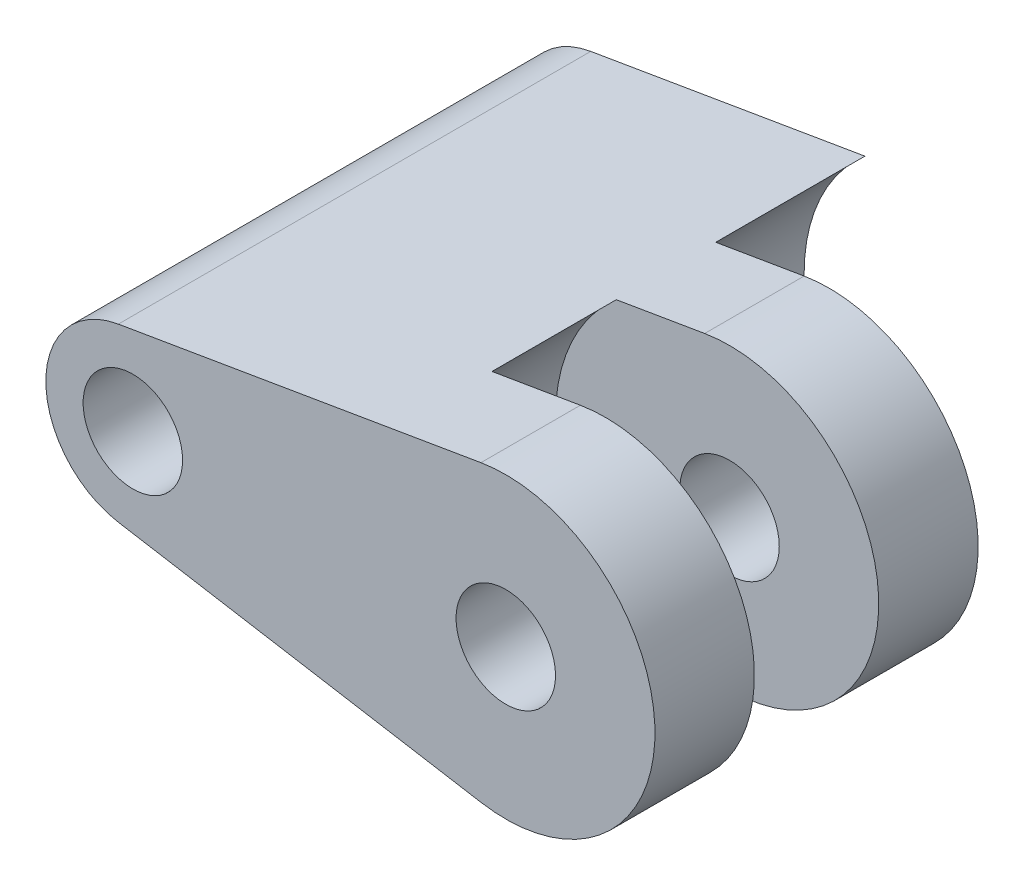
ISO-10303-21;
HEADER;
FILE_DESCRIPTION(('STEP AP214'),'2;1');
FILE_NAME('part.step','',(''),(''),'','','');
FILE_SCHEMA(('AUTOMOTIVE_DESIGN { 1 0 10303 214 1 1 1 1 }'));
ENDSEC;
DATA;
#1=APPLICATION_CONTEXT('core data for automotive mechanical design processes');
#2=APPLICATION_PROTOCOL_DEFINITION('international standard','automotive_design',2000,#1);
#3=PRODUCT_CONTEXT('',#1,'mechanical');
#4=PRODUCT('Part','Part','',(#3));
#5=PRODUCT_RELATED_PRODUCT_CATEGORY('part','',(#4));
#6=PRODUCT_DEFINITION_FORMATION('','',#4);
#7=PRODUCT_DEFINITION_CONTEXT('part definition',#1,'design');
#8=PRODUCT_DEFINITION('design','',#6,#7);
#9=PRODUCT_DEFINITION_SHAPE('','',#8);
#10=(LENGTH_UNIT() NAMED_UNIT(*) SI_UNIT(.MILLI.,.METRE.));
#11=(NAMED_UNIT(*) PLANE_ANGLE_UNIT() SI_UNIT($,.RADIAN.));
#12=(NAMED_UNIT(*) SI_UNIT($,.STERADIAN.) SOLID_ANGLE_UNIT());
#13=UNCERTAINTY_MEASURE_WITH_UNIT(LENGTH_MEASURE(1.E-05),#10,'distance_accuracy_value','');
#14=(GEOMETRIC_REPRESENTATION_CONTEXT(3) GLOBAL_UNCERTAINTY_ASSIGNED_CONTEXT((#13)) GLOBAL_UNIT_ASSIGNED_CONTEXT((#10,
#11,#12)) REPRESENTATION_CONTEXT('',''));
#15=CARTESIAN_POINT('',(0.,0.,0.));
#16=DIRECTION('',(0.,0.,1.));
#17=DIRECTION('',(1.,0.,0.));
#18=AXIS2_PLACEMENT_3D('',#15,#16,#17);
#19=CARTESIAN_POINT('',(15.,0.,19.));
#20=DIRECTION('',(0.,0.,-1.));
#21=DIRECTION('',(-1.,0.,0.));
#22=AXIS2_PLACEMENT_3D('',#19,#20,#21);
#23=CYLINDRICAL_SURFACE('',#22,7.);
#24=DIRECTION('',(0.,0.,-1.));
#25=VECTOR('',#24,1.);
#26=CARTESIAN_POINT('',(10.4448784987164,5.31515457052229,19.));
#27=LINE('',#26,#25);
#28=CARTESIAN_POINT('',(10.4448784987164,5.31515457052229,15.));
#29=VERTEX_POINT('',#28);
#30=CARTESIAN_POINT('',(10.4448784987164,5.31515457052229,10.));
#31=VERTEX_POINT('',#30);
#32=EDGE_CURVE('E62',#29,#31,#27,.T.);
#33=ORIENTED_EDGE('',*,*,#32,.F.);
#34=CARTESIAN_POINT('',(15.,0.,15.));
#35=DIRECTION('',(0.,0.,1.));
#36=DIRECTION('',(1.,0.,0.));
#37=AXIS2_PLACEMENT_3D('',#34,#35,#36);
#38=CIRCLE('',#37,7.);
#39=CARTESIAN_POINT('',(10.4448784987164,-5.31515457052229,15.));
#40=VERTEX_POINT('',#39);
#41=EDGE_CURVE('E57',#29,#40,#38,.T.);
#42=ORIENTED_EDGE('',*,*,#41,.T.);
#43=DIRECTION('',(0.,0.,-1.));
#44=VECTOR('',#43,1.);
#45=CARTESIAN_POINT('',(10.4448784987164,-5.31515457052229,19.));
#46=LINE('',#45,#44);
#47=CARTESIAN_POINT('',(10.4448784987164,-5.31515457052229,10.));
#48=VERTEX_POINT('',#47);
#49=EDGE_CURVE('E50',#40,#48,#46,.T.);
#50=ORIENTED_EDGE('',*,*,#49,.T.);
#51=CARTESIAN_POINT('',(15.,0.,10.));
#52=DIRECTION('',(0.,0.,1.));
#53=DIRECTION('',(1.,0.,0.));
#54=AXIS2_PLACEMENT_3D('',#51,#52,#53);
#55=CIRCLE('',#54,7.);
#56=EDGE_CURVE('E174',#31,#48,#55,.T.);
#57=ORIENTED_EDGE('',*,*,#56,.F.);
#58=EDGE_LOOP('',(#33,#42,#50,#57));
#59=FACE_BOUND('',#58,.T.);
#60=ADVANCED_FACE('F41',(#59),#23,.F.);
#61=CARTESIAN_POINT('',(10.4448784987164,5.31515457052229,6.));
#62=VERTEX_POINT('',#61);
#63=CARTESIAN_POINT('',(10.4448784987164,5.31515457052229,0.));
#64=VERTEX_POINT('',#63);
#65=EDGE_CURVE('E243',#62,#64,#27,.T.);
#66=ORIENTED_EDGE('',*,*,#65,.F.);
#67=CARTESIAN_POINT('',(15.,0.,6.));
#68=DIRECTION('',(0.,0.,1.));
#69=DIRECTION('',(1.,0.,0.));
#70=AXIS2_PLACEMENT_3D('',#67,#68,#69);
#71=CIRCLE('',#70,7.);
#72=CARTESIAN_POINT('',(10.4448784987164,-5.31515457052229,6.));
#73=VERTEX_POINT('',#72);
#74=EDGE_CURVE('E193',#62,#73,#71,.T.);
#75=ORIENTED_EDGE('',*,*,#74,.T.);
#76=CARTESIAN_POINT('',(10.4448784987164,-5.31515457052229,0.));
#77=VERTEX_POINT('',#76);
#78=EDGE_CURVE('E245',#73,#77,#46,.T.);
#79=ORIENTED_EDGE('',*,*,#78,.T.);
#80=CARTESIAN_POINT('',(15.,0.,0.));
#81=DIRECTION('',(0.,0.,1.));
#82=DIRECTION('',(1.,0.,0.));
#83=AXIS2_PLACEMENT_3D('',#80,#81,#82);
#84=CIRCLE('',#83,7.);
#85=EDGE_CURVE('E234',#64,#77,#84,.T.);
#86=ORIENTED_EDGE('',*,*,#85,.F.);
#87=EDGE_LOOP('',(#66,#75,#79,#86));
#88=FACE_BOUND('',#87,.T.);
#89=ADVANCED_FACE('F252',(#88),#23,.F.);
#90=CARTESIAN_POINT('',(0.,0.,19.));
#91=DIRECTION('',(0.,0.,-1.));
#92=DIRECTION('',(-1.,0.,0.));
#93=AXIS2_PLACEMENT_3D('',#90,#91,#92);
#94=CYLINDRICAL_SURFACE('',#93,3.5);
#95=CARTESIAN_POINT('',(0.,0.,0.));
#96=DIRECTION('',(0.,0.,1.));
#97=DIRECTION('',(1.,0.,0.));
#98=AXIS2_PLACEMENT_3D('',#95,#96,#97);
#99=CIRCLE('',#98,3.5);
#100=CARTESIAN_POINT('',(-0.583333333333333,3.45104654014144,0.));
#101=VERTEX_POINT('',#100);
#102=CARTESIAN_POINT('',(-0.583333333333333,-3.45104654014144,0.));
#103=VERTEX_POINT('',#102);
#104=EDGE_CURVE('E227',#101,#103,#99,.T.);
#105=ORIENTED_EDGE('',*,*,#104,.T.);
#106=DIRECTION('',(0.,0.,-1.));
#107=VECTOR('',#106,1.);
#108=CARTESIAN_POINT('',(-0.583333333333333,-3.45104654014144,19.));
#109=LINE('',#108,#107);
#110=CARTESIAN_POINT('',(-0.583333333333333,-3.45104654014144,19.));
#111=VERTEX_POINT('',#110);
#112=EDGE_CURVE('E11',#111,#103,#109,.T.);
#113=ORIENTED_EDGE('',*,*,#112,.F.);
#114=CARTESIAN_POINT('',(0.,0.,19.));
#115=DIRECTION('',(0.,0.,1.));
#116=DIRECTION('',(1.,0.,0.));
#117=AXIS2_PLACEMENT_3D('',#114,#115,#116);
#118=CIRCLE('',#117,3.5);
#119=CARTESIAN_POINT('',(-0.583333333333333,3.45104654014144,19.));
#120=VERTEX_POINT('',#119);
#121=EDGE_CURVE('E126',#120,#111,#118,.T.);
#122=ORIENTED_EDGE('',*,*,#121,.F.);
#123=DIRECTION('',(0.,0.,-1.));
#124=VECTOR('',#123,1.);
#125=CARTESIAN_POINT('',(-0.583333333333333,3.45104654014144,19.));
#126=LINE('',#125,#124);
#127=EDGE_CURVE('E223',#120,#101,#126,.T.);
#128=ORIENTED_EDGE('',*,*,#127,.T.);
#129=EDGE_LOOP('',(#105,#113,#122,#128));
#130=FACE_BOUND('',#129,.T.);
#131=ADVANCED_FACE('F296',(#130),#94,.T.);
#132=CARTESIAN_POINT('',(-0.583333333333333,-3.45104654014144,19.));
#133=DIRECTION('',(0.166666666666667,0.986013297183269,0.));
#134=DIRECTION('',(-0.986013297183269,0.166666666666667,0.));
#135=AXIS2_PLACEMENT_3D('',#132,#133,#134);
#136=PLANE('',#135);
#137=DIRECTION('',(0.986013297183269,-0.166666666666667,0.));
#138=VECTOR('',#137,1.);
#139=CARTESIAN_POINT('',(-0.583333333333333,-3.45104654014144,0.));
#140=LINE('',#139,#138);
#141=EDGE_CURVE('E231',#103,#77,#140,.T.);
#142=ORIENTED_EDGE('',*,*,#141,.T.);
#143=ORIENTED_EDGE('',*,*,#78,.F.);
#144=DIRECTION('',(0.986013297183269,-0.166666666666667,0.));
#145=VECTOR('',#144,1.);
#146=CARTESIAN_POINT('',(-0.583333333333333,-3.45104654014144,6.));
#147=LINE('',#146,#145);
#148=CARTESIAN_POINT('',(14.,-5.91607978309961,6.));
#149=VERTEX_POINT('',#148);
#150=EDGE_CURVE('E197',#73,#149,#147,.T.);
#151=ORIENTED_EDGE('',*,*,#150,.T.);
#152=DIRECTION('',(0.,0.,-1.));
#153=VECTOR('',#152,1.);
#154=CARTESIAN_POINT('',(14.,-5.91607978309961,10.));
#155=LINE('',#154,#153);
#156=CARTESIAN_POINT('',(14.,-5.91607978309961,10.));
#157=VERTEX_POINT('',#156);
#158=EDGE_CURVE('E209',#157,#149,#155,.T.);
#159=ORIENTED_EDGE('',*,*,#158,.F.);
#160=DIRECTION('',(0.986013297183269,-0.166666666666667,0.));
#161=VECTOR('',#160,1.);
#162=CARTESIAN_POINT('',(-0.583333333333333,-3.45104654014144,10.));
#163=LINE('',#162,#161);
#164=EDGE_CURVE('E179',#48,#157,#163,.T.);
#165=ORIENTED_EDGE('',*,*,#164,.F.);
#166=ORIENTED_EDGE('',*,*,#49,.F.);
#167=DIRECTION('',(0.986013297183269,-0.166666666666667,0.));
#168=VECTOR('',#167,1.);
#169=CARTESIAN_POINT('',(-0.583333333333333,-3.45104654014144,15.));
#170=LINE('',#169,#168);
#171=CARTESIAN_POINT('',(14.,-5.91607978309961,15.));
#172=VERTEX_POINT('',#171);
#173=EDGE_CURVE('E137',#40,#172,#170,.T.);
#174=ORIENTED_EDGE('',*,*,#173,.T.);
#175=DIRECTION('',(0.,0.,-1.));
#176=VECTOR('',#175,1.);
#177=CARTESIAN_POINT('',(14.,-5.91607978309961,19.));
#178=LINE('',#177,#176);
#179=CARTESIAN_POINT('',(14.,-5.91607978309961,19.));
#180=VERTEX_POINT('',#179);
#181=EDGE_CURVE('E133',#180,#172,#178,.T.);
#182=ORIENTED_EDGE('',*,*,#181,.F.);
#183=DIRECTION('',(0.986013297183269,-0.166666666666667,0.));
#184=VECTOR('',#183,1.);
#185=CARTESIAN_POINT('',(-0.583333333333333,-3.45104654014144,19.));
#186=LINE('',#185,#184);
#187=EDGE_CURVE('E117',#111,#180,#186,.T.);
#188=ORIENTED_EDGE('',*,*,#187,.F.);
#189=ORIENTED_EDGE('',*,*,#112,.T.);
#190=EDGE_LOOP('',(#142,#143,#151,#159,#165,#166,#174,#182,#188,#189));
#191=FACE_BOUND('',#190,.T.);
#192=ADVANCED_FACE('F135',(#191),#136,.F.);
#193=CARTESIAN_POINT('',(0.,0.,19.));
#194=DIRECTION('',(0.,0.,-1.));
#195=DIRECTION('',(-1.,0.,0.));
#196=AXIS2_PLACEMENT_3D('',#193,#194,#195);
#197=CYLINDRICAL_SURFACE('',#196,2.);
#198=CARTESIAN_POINT('',(0.,0.,19.));
#199=DIRECTION('',(0.,0.,1.));
#200=DIRECTION('',(1.,0.,0.));
#201=AXIS2_PLACEMENT_3D('',#198,#199,#200);
#202=CIRCLE('',#201,2.);
#203=CARTESIAN_POINT('',(2.,0.,19.));
#204=VERTEX_POINT('',#203);
#205=EDGE_CURVE('E214',#204,#204,#202,.T.);
#206=ORIENTED_EDGE('',*,*,#205,.T.);
#207=EDGE_LOOP('',(#206));
#208=FACE_BOUND('',#207,.T.);
#209=CARTESIAN_POINT('',(0.,0.,0.));
#210=DIRECTION('',(0.,0.,1.));
#211=DIRECTION('',(1.,0.,0.));
#212=AXIS2_PLACEMENT_3D('',#209,#210,#211);
#213=CIRCLE('',#212,2.);
#214=CARTESIAN_POINT('',(2.,0.,0.));
#215=VERTEX_POINT('',#214);
#216=EDGE_CURVE('E213',#215,#215,#213,.T.);
#217=ORIENTED_EDGE('',*,*,#216,.F.);
#218=EDGE_LOOP('',(#217));
#219=FACE_BOUND('',#218,.T.);
#220=ADVANCED_FACE('F43',(#208,#219),#197,.F.);
#221=CARTESIAN_POINT('',(-0.583333333333333,3.45104654014144,19.));
#222=DIRECTION('',(-0.166666666666667,0.986013297183269,0.));
#223=DIRECTION('',(-0.986013297183269,-0.166666666666667,0.));
#224=AXIS2_PLACEMENT_3D('',#221,#222,#223);
#225=PLANE('',#224);
#226=DIRECTION('',(0.986013297183269,0.166666666666667,0.));
#227=VECTOR('',#226,1.);
#228=CARTESIAN_POINT('',(-0.583333333333333,3.45104654014144,0.));
#229=LINE('',#228,#227);
#230=EDGE_CURVE('E218',#101,#64,#229,.T.);
#231=ORIENTED_EDGE('',*,*,#230,.F.);
#232=ORIENTED_EDGE('',*,*,#127,.F.);
#233=DIRECTION('',(0.986013297183269,0.166666666666667,0.));
#234=VECTOR('',#233,1.);
#235=CARTESIAN_POINT('',(-0.583333333333333,3.45104654014144,19.));
#236=LINE('',#235,#234);
#237=CARTESIAN_POINT('',(14.,5.91607978309962,19.));
#238=VERTEX_POINT('',#237);
#239=EDGE_CURVE('E130',#120,#238,#236,.T.);
#240=ORIENTED_EDGE('',*,*,#239,.T.);
#241=DIRECTION('',(0.,0.,-1.));
#242=VECTOR('',#241,1.);
#243=CARTESIAN_POINT('',(14.,5.91607978309962,19.));
#244=LINE('',#243,#242);
#245=CARTESIAN_POINT('',(14.,5.91607978309962,15.));
#246=VERTEX_POINT('',#245);
#247=EDGE_CURVE('E143',#238,#246,#244,.T.);
#248=ORIENTED_EDGE('',*,*,#247,.T.);
#249=DIRECTION('',(0.986013297183269,0.166666666666667,0.));
#250=VECTOR('',#249,1.);
#251=CARTESIAN_POINT('',(-0.583333333333333,3.45104654014144,15.));
#252=LINE('',#251,#250);
#253=EDGE_CURVE('E158',#29,#246,#252,.T.);
#254=ORIENTED_EDGE('',*,*,#253,.F.);
#255=ORIENTED_EDGE('',*,*,#32,.T.);
#256=DIRECTION('',(0.986013297183269,0.166666666666667,0.));
#257=VECTOR('',#256,1.);
#258=CARTESIAN_POINT('',(-0.583333333333333,3.45104654014144,10.));
#259=LINE('',#258,#257);
#260=CARTESIAN_POINT('',(14.,5.91607978309962,10.));
#261=VERTEX_POINT('',#260);
#262=EDGE_CURVE('E170',#31,#261,#259,.T.);
#263=ORIENTED_EDGE('',*,*,#262,.T.);
#264=DIRECTION('',(0.,0.,-1.));
#265=VECTOR('',#264,1.);
#266=CARTESIAN_POINT('',(14.,5.91607978309962,10.));
#267=LINE('',#266,#265);
#268=CARTESIAN_POINT('',(14.,5.91607978309962,6.));
#269=VERTEX_POINT('',#268);
#270=EDGE_CURVE('E189',#261,#269,#267,.T.);
#271=ORIENTED_EDGE('',*,*,#270,.T.);
#272=DIRECTION('',(0.986013297183269,0.166666666666667,0.));
#273=VECTOR('',#272,1.);
#274=CARTESIAN_POINT('',(-0.583333333333333,3.45104654014144,6.));
#275=LINE('',#274,#273);
#276=EDGE_CURVE('E142',#62,#269,#275,.T.);
#277=ORIENTED_EDGE('',*,*,#276,.F.);
#278=ORIENTED_EDGE('',*,*,#65,.T.);
#279=EDGE_LOOP('',(#231,#232,#240,#248,#254,#255,#263,#271,#277,#278));
#280=FACE_BOUND('',#279,.T.);
#281=ADVANCED_FACE('F259',(#280),#225,.T.);
#282=CARTESIAN_POINT('',(0.,0.,19.));
#283=DIRECTION('',(0.,0.,1.));
#284=DIRECTION('',(1.,0.,0.));
#285=AXIS2_PLACEMENT_3D('',#282,#283,#284);
#286=PLANE('',#285);
#287=ORIENTED_EDGE('',*,*,#205,.F.);
#288=EDGE_LOOP('',(#287));
#289=FACE_BOUND('',#288,.T.);
#290=ORIENTED_EDGE('',*,*,#121,.T.);
#291=ORIENTED_EDGE('',*,*,#187,.T.);
#292=CARTESIAN_POINT('',(15.,0.,19.));
#293=DIRECTION('',(0.,0.,1.));
#294=DIRECTION('',(1.,0.,0.));
#295=AXIS2_PLACEMENT_3D('',#292,#293,#294);
#296=CIRCLE('',#295,6.);
#297=EDGE_CURVE('E123',#180,#238,#296,.T.);
#298=ORIENTED_EDGE('',*,*,#297,.T.);
#299=ORIENTED_EDGE('',*,*,#239,.F.);
#300=EDGE_LOOP('',(#290,#291,#298,#299));
#301=FACE_BOUND('',#300,.T.);
#302=CARTESIAN_POINT('',(15.,0.,19.));
#303=DIRECTION('',(0.,0.,1.));
#304=DIRECTION('',(1.,0.,0.));
#305=AXIS2_PLACEMENT_3D('',#302,#303,#304);
#306=CIRCLE('',#305,2.);
#307=CARTESIAN_POINT('',(17.,0.,19.));
#308=VERTEX_POINT('',#307);
#309=EDGE_CURVE('E147',#308,#308,#306,.T.);
#310=ORIENTED_EDGE('',*,*,#309,.F.);
#311=EDGE_LOOP('',(#310));
#312=FACE_BOUND('',#311,.T.);
#313=ADVANCED_FACE('F119',(#289,#301,#312),#286,.T.);
#314=CARTESIAN_POINT('',(0.,0.,0.));
#315=DIRECTION('',(0.,0.,1.));
#316=DIRECTION('',(1.,0.,0.));
#317=AXIS2_PLACEMENT_3D('',#314,#315,#316);
#318=PLANE('',#317);
#319=ORIENTED_EDGE('',*,*,#216,.T.);
#320=EDGE_LOOP('',(#319));
#321=FACE_BOUND('',#320,.T.);
#322=ORIENTED_EDGE('',*,*,#104,.F.);
#323=ORIENTED_EDGE('',*,*,#230,.T.);
#324=ORIENTED_EDGE('',*,*,#85,.T.);
#325=ORIENTED_EDGE('',*,*,#141,.F.);
#326=EDGE_LOOP('',(#322,#323,#324,#325));
#327=FACE_BOUND('',#326,.T.);
#328=ADVANCED_FACE('F256',(#321,#327),#318,.F.);
#329=CARTESIAN_POINT('',(15.,0.,10.));
#330=DIRECTION('',(0.,0.,-1.));
#331=DIRECTION('',(-1.,0.,0.));
#332=AXIS2_PLACEMENT_3D('',#329,#330,#331);
#333=CYLINDRICAL_SURFACE('',#332,6.);
#334=CARTESIAN_POINT('',(15.,0.,6.));
#335=DIRECTION('',(0.,0.,1.));
#336=DIRECTION('',(1.,0.,0.));
#337=AXIS2_PLACEMENT_3D('',#334,#335,#336);
#338=CIRCLE('',#337,6.);
#339=EDGE_CURVE('E200',#149,#269,#338,.T.);
#340=ORIENTED_EDGE('',*,*,#339,.T.);
#341=ORIENTED_EDGE('',*,*,#270,.F.);
#342=CARTESIAN_POINT('',(15.,0.,10.));
#343=DIRECTION('',(0.,0.,1.));
#344=DIRECTION('',(1.,0.,0.));
#345=AXIS2_PLACEMENT_3D('',#342,#343,#344);
#346=CIRCLE('',#345,6.);
#347=EDGE_CURVE('E182',#157,#261,#346,.T.);
#348=ORIENTED_EDGE('',*,*,#347,.F.);
#349=ORIENTED_EDGE('',*,*,#158,.T.);
#350=EDGE_LOOP('',(#340,#341,#348,#349));
#351=FACE_BOUND('',#350,.T.);
#352=ADVANCED_FACE('F270',(#351),#333,.T.);
#353=CARTESIAN_POINT('',(15.,0.,10.));
#354=DIRECTION('',(0.,0.,-1.));
#355=DIRECTION('',(-1.,0.,0.));
#356=AXIS2_PLACEMENT_3D('',#353,#354,#355);
#357=CYLINDRICAL_SURFACE('',#356,2.);
#358=CARTESIAN_POINT('',(15.,0.,10.));
#359=DIRECTION('',(0.,0.,1.));
#360=DIRECTION('',(1.,0.,0.));
#361=AXIS2_PLACEMENT_3D('',#358,#359,#360);
#362=CIRCLE('',#361,2.);
#363=CARTESIAN_POINT('',(17.,0.,10.));
#364=VERTEX_POINT('',#363);
#365=EDGE_CURVE('E185',#364,#364,#362,.T.);
#366=ORIENTED_EDGE('',*,*,#365,.T.);
#367=EDGE_LOOP('',(#366));
#368=FACE_BOUND('',#367,.T.);
#369=CARTESIAN_POINT('',(15.,0.,6.));
#370=DIRECTION('',(0.,0.,1.));
#371=DIRECTION('',(1.,0.,0.));
#372=AXIS2_PLACEMENT_3D('',#369,#370,#371);
#373=CIRCLE('',#372,2.);
#374=CARTESIAN_POINT('',(17.,0.,6.));
#375=VERTEX_POINT('',#374);
#376=EDGE_CURVE('E175',#375,#375,#373,.T.);
#377=ORIENTED_EDGE('',*,*,#376,.F.);
#378=EDGE_LOOP('',(#377));
#379=FACE_BOUND('',#378,.T.);
#380=ADVANCED_FACE('F342',(#368,#379),#357,.F.);
#381=CARTESIAN_POINT('',(0.,0.,10.));
#382=DIRECTION('',(0.,0.,1.));
#383=DIRECTION('',(1.,0.,0.));
#384=AXIS2_PLACEMENT_3D('',#381,#382,#383);
#385=PLANE('',#384);
#386=ORIENTED_EDGE('',*,*,#262,.F.);
#387=ORIENTED_EDGE('',*,*,#56,.T.);
#388=ORIENTED_EDGE('',*,*,#164,.T.);
#389=ORIENTED_EDGE('',*,*,#347,.T.);
#390=EDGE_LOOP('',(#386,#387,#388,#389));
#391=FACE_BOUND('',#390,.T.);
#392=ORIENTED_EDGE('',*,*,#365,.F.);
#393=EDGE_LOOP('',(#392));
#394=FACE_BOUND('',#393,.T.);
#395=ADVANCED_FACE('F273',(#391,#394),#385,.T.);
#396=CARTESIAN_POINT('',(0.,0.,6.));
#397=DIRECTION('',(0.,0.,1.));
#398=DIRECTION('',(1.,0.,0.));
#399=AXIS2_PLACEMENT_3D('',#396,#397,#398);
#400=PLANE('',#399);
#401=ORIENTED_EDGE('',*,*,#276,.T.);
#402=ORIENTED_EDGE('',*,*,#339,.F.);
#403=ORIENTED_EDGE('',*,*,#150,.F.);
#404=ORIENTED_EDGE('',*,*,#74,.F.);
#405=EDGE_LOOP('',(#401,#402,#403,#404));
#406=FACE_BOUND('',#405,.T.);
#407=ORIENTED_EDGE('',*,*,#376,.T.);
#408=EDGE_LOOP('',(#407));
#409=FACE_BOUND('',#408,.T.);
#410=ADVANCED_FACE('F264',(#406,#409),#400,.F.);
#411=CARTESIAN_POINT('',(15.,0.,19.));
#412=DIRECTION('',(0.,0.,-1.));
#413=DIRECTION('',(-1.,0.,0.));
#414=AXIS2_PLACEMENT_3D('',#411,#412,#413);
#415=CYLINDRICAL_SURFACE('',#414,6.);
#416=CARTESIAN_POINT('',(15.,0.,15.));
#417=DIRECTION('',(0.,0.,1.));
#418=DIRECTION('',(1.,0.,0.));
#419=AXIS2_PLACEMENT_3D('',#416,#417,#418);
#420=CIRCLE('',#419,6.);
#421=EDGE_CURVE('E155',#172,#246,#420,.T.);
#422=ORIENTED_EDGE('',*,*,#421,.T.);
#423=ORIENTED_EDGE('',*,*,#247,.F.);
#424=ORIENTED_EDGE('',*,*,#297,.F.);
#425=ORIENTED_EDGE('',*,*,#181,.T.);
#426=EDGE_LOOP('',(#422,#423,#424,#425));
#427=FACE_BOUND('',#426,.T.);
#428=ADVANCED_FACE('F145',(#427),#415,.T.);
#429=CARTESIAN_POINT('',(15.,0.,19.));
#430=DIRECTION('',(0.,0.,-1.));
#431=DIRECTION('',(-1.,0.,0.));
#432=AXIS2_PLACEMENT_3D('',#429,#430,#431);
#433=CYLINDRICAL_SURFACE('',#432,2.);
#434=ORIENTED_EDGE('',*,*,#309,.T.);
#435=EDGE_LOOP('',(#434));
#436=FACE_BOUND('',#435,.T.);
#437=CARTESIAN_POINT('',(15.,0.,15.));
#438=DIRECTION('',(0.,0.,1.));
#439=DIRECTION('',(1.,0.,0.));
#440=AXIS2_PLACEMENT_3D('',#437,#438,#439);
#441=CIRCLE('',#440,2.);
#442=CARTESIAN_POINT('',(17.,0.,15.));
#443=VERTEX_POINT('',#442);
#444=EDGE_CURVE('E148',#443,#443,#441,.T.);
#445=ORIENTED_EDGE('',*,*,#444,.F.);
#446=EDGE_LOOP('',(#445));
#447=FACE_BOUND('',#446,.T.);
#448=ADVANCED_FACE('F280',(#436,#447),#433,.F.);
#449=CARTESIAN_POINT('',(0.,0.,15.));
#450=DIRECTION('',(0.,0.,1.));
#451=DIRECTION('',(1.,0.,0.));
#452=AXIS2_PLACEMENT_3D('',#449,#450,#451);
#453=PLANE('',#452);
#454=ORIENTED_EDGE('',*,*,#253,.T.);
#455=ORIENTED_EDGE('',*,*,#421,.F.);
#456=ORIENTED_EDGE('',*,*,#173,.F.);
#457=ORIENTED_EDGE('',*,*,#41,.F.);
#458=EDGE_LOOP('',(#454,#455,#456,#457));
#459=FACE_BOUND('',#458,.T.);
#460=ORIENTED_EDGE('',*,*,#444,.T.);
#461=EDGE_LOOP('',(#460));
#462=FACE_BOUND('',#461,.T.);
#463=ADVANCED_FACE('F276',(#459,#462),#453,.F.);
#464=CLOSED_SHELL('',(#60,#89,#131,#192,#220,#281,#313,#328,#352,#380,#395,#410,#428,#448,#463));
#465=MANIFOLD_SOLID_BREP('B2',#464);
#466=ADVANCED_BREP_SHAPE_REPRESENTATION('',(#18,#465),#14);
#467=SHAPE_DEFINITION_REPRESENTATION(#9,#466);
ENDSEC;
END-ISO-10303-21;
